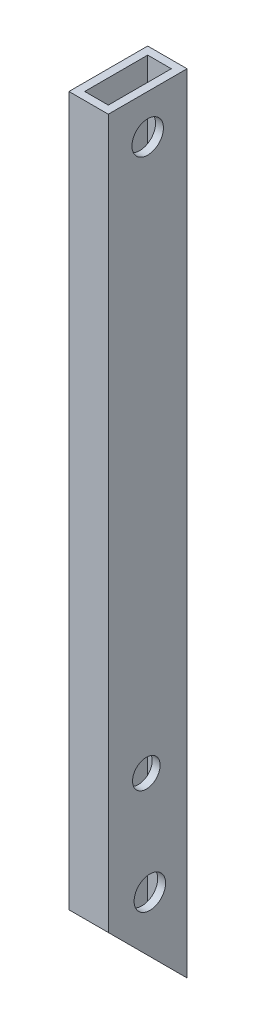
ISO-10303-21;
HEADER;
FILE_DESCRIPTION(('STEP AP214'),'2;1');
FILE_NAME('part.step','',(''),(''),'','','');
FILE_SCHEMA(('AUTOMOTIVE_DESIGN { 1 0 10303 214 1 1 1 1 }'));
ENDSEC;
DATA;
#1=APPLICATION_CONTEXT('core data for automotive mechanical design processes');
#2=APPLICATION_PROTOCOL_DEFINITION('international standard','automotive_design',2000,#1);
#3=PRODUCT_CONTEXT('',#1,'mechanical');
#4=PRODUCT('Part','Part','',(#3));
#5=PRODUCT_RELATED_PRODUCT_CATEGORY('part','',(#4));
#6=PRODUCT_DEFINITION_FORMATION('','',#4);
#7=PRODUCT_DEFINITION_CONTEXT('part definition',#1,'design');
#8=PRODUCT_DEFINITION('design','',#6,#7);
#9=PRODUCT_DEFINITION_SHAPE('','',#8);
#10=(LENGTH_UNIT() NAMED_UNIT(*) SI_UNIT(.MILLI.,.METRE.));
#11=(NAMED_UNIT(*) PLANE_ANGLE_UNIT() SI_UNIT($,.RADIAN.));
#12=(NAMED_UNIT(*) SI_UNIT($,.STERADIAN.) SOLID_ANGLE_UNIT());
#13=UNCERTAINTY_MEASURE_WITH_UNIT(LENGTH_MEASURE(1.E-05),#10,'distance_accuracy_value','');
#14=(GEOMETRIC_REPRESENTATION_CONTEXT(3) GLOBAL_UNCERTAINTY_ASSIGNED_CONTEXT((#13)) GLOBAL_UNIT_ASSIGNED_CONTEXT((#10,
#11,#12)) REPRESENTATION_CONTEXT('',''));
#15=CARTESIAN_POINT('',(0.,0.,0.));
#16=DIRECTION('',(0.,0.,1.));
#17=DIRECTION('',(1.,0.,0.));
#18=AXIS2_PLACEMENT_3D('',#15,#16,#17);
#19=CARTESIAN_POINT('',(0.,100.,20.));
#20=DIRECTION('',(0.,1.,0.));
#21=DIRECTION('',(0.,0.,1.));
#22=AXIS2_PLACEMENT_3D('',#19,#20,#21);
#23=PLANE('',#22);
#24=DIRECTION('',(1.,0.,0.));
#25=VECTOR('',#24,1.);
#26=CARTESIAN_POINT('',(0.,100.,0.));
#27=LINE('',#26,#25);
#28=CARTESIAN_POINT('',(-5.00000000000001,100.,0.));
#29=VERTEX_POINT('',#28);
#30=CARTESIAN_POINT('',(4.99999999999999,100.,0.));
#31=VERTEX_POINT('',#30);
#32=EDGE_CURVE('E138',#29,#31,#27,.T.);
#33=ORIENTED_EDGE('',*,*,#32,.F.);
#34=DIRECTION('',(0.,0.,-1.));
#35=VECTOR('',#34,1.);
#36=CARTESIAN_POINT('',(-5.00000000000001,100.,20.));
#37=LINE('',#36,#35);
#38=CARTESIAN_POINT('',(-5.00000000000001,100.,20.));
#39=VERTEX_POINT('',#38);
#40=EDGE_CURVE('E135',#39,#29,#37,.T.);
#41=ORIENTED_EDGE('',*,*,#40,.F.);
#42=DIRECTION('',(1.,0.,0.));
#43=VECTOR('',#42,1.);
#44=CARTESIAN_POINT('',(0.,100.,20.));
#45=LINE('',#44,#43);
#46=CARTESIAN_POINT('',(4.99999999999999,100.,20.));
#47=VERTEX_POINT('',#46);
#48=EDGE_CURVE('E126',#39,#47,#45,.T.);
#49=ORIENTED_EDGE('',*,*,#48,.T.);
#50=DIRECTION('',(0.,0.,-1.));
#51=VECTOR('',#50,1.);
#52=CARTESIAN_POINT('',(4.99999999999999,100.,20.));
#53=LINE('',#52,#51);
#54=EDGE_CURVE('E44',#47,#31,#53,.T.);
#55=ORIENTED_EDGE('',*,*,#54,.T.);
#56=EDGE_LOOP('',(#33,#41,#49,#55));
#57=FACE_BOUND('',#56,.T.);
#58=DIRECTION('',(0.,0.,-1.));
#59=VECTOR('',#58,1.);
#60=CARTESIAN_POINT('',(-3.00000000000001,100.,20.));
#61=LINE('',#60,#59);
#62=CARTESIAN_POINT('',(-3.00000000000001,100.,18.));
#63=VERTEX_POINT('',#62);
#64=CARTESIAN_POINT('',(-3.00000000000001,100.,2.));
#65=VERTEX_POINT('',#64);
#66=EDGE_CURVE('E198',#63,#65,#61,.T.);
#67=ORIENTED_EDGE('',*,*,#66,.T.);
#68=DIRECTION('',(1.,0.,0.));
#69=VECTOR('',#68,1.);
#70=CARTESIAN_POINT('',(0.,100.,2.));
#71=LINE('',#70,#69);
#72=CARTESIAN_POINT('',(2.99999999999999,100.,2.));
#73=VERTEX_POINT('',#72);
#74=EDGE_CURVE('E191',#65,#73,#71,.T.);
#75=ORIENTED_EDGE('',*,*,#74,.T.);
#76=DIRECTION('',(0.,0.,-1.));
#77=VECTOR('',#76,1.);
#78=CARTESIAN_POINT('',(2.99999999999999,100.,20.));
#79=LINE('',#78,#77);
#80=CARTESIAN_POINT('',(2.99999999999999,100.,18.));
#81=VERTEX_POINT('',#80);
#82=EDGE_CURVE('E139',#81,#73,#79,.T.);
#83=ORIENTED_EDGE('',*,*,#82,.F.);
#84=DIRECTION('',(1.,0.,0.));
#85=VECTOR('',#84,1.);
#86=CARTESIAN_POINT('',(0.,100.,18.));
#87=LINE('',#86,#85);
#88=EDGE_CURVE('E59',#63,#81,#87,.T.);
#89=ORIENTED_EDGE('',*,*,#88,.F.);
#90=EDGE_LOOP('',(#67,#75,#83,#89));
#91=FACE_BOUND('',#90,.T.);
#92=ADVANCED_FACE('F35',(#57,#91),#23,.T.);
#93=CARTESIAN_POINT('',(5.,0.,20.));
#94=DIRECTION('',(1.,0.,0.));
#95=DIRECTION('',(0.,1.,0.));
#96=AXIS2_PLACEMENT_3D('',#93,#94,#95);
#97=PLANE('',#96);
#98=CARTESIAN_POINT('',(5.00000000000001,-76.4045327297385,9.45333164649026));
#99=DIRECTION('',(1.,0.,0.));
#100=DIRECTION('',(0.,1.,0.));
#101=AXIS2_PLACEMENT_3D('',#98,#99,#100);
#102=CIRCLE('',#101,3.99999999998037);
#103=CARTESIAN_POINT('',(5.00000000000001,-72.4045327297581,9.45333164649026));
#104=VERTEX_POINT('',#103);
#105=EDGE_CURVE('E159',#104,#104,#102,.T.);
#106=ORIENTED_EDGE('',*,*,#105,.F.);
#107=EDGE_LOOP('',(#106));
#108=FACE_BOUND('',#107,.T.);
#109=CARTESIAN_POINT('',(5.00000000000001,-49.7720006322351,10.3471769088981));
#110=DIRECTION('',(1.,0.,0.));
#111=DIRECTION('',(0.,1.,0.));
#112=AXIS2_PLACEMENT_3D('',#109,#110,#111);
#113=CIRCLE('',#112,3.5);
#114=CARTESIAN_POINT('',(5.00000000000001,-46.2720006322351,10.3471769088981));
#115=VERTEX_POINT('',#114);
#116=EDGE_CURVE('E169',#115,#115,#113,.T.);
#117=ORIENTED_EDGE('',*,*,#116,.F.);
#118=EDGE_LOOP('',(#117));
#119=FACE_BOUND('',#118,.T.);
#120=CARTESIAN_POINT('',(4.99999999999999,90.,10.));
#121=DIRECTION('',(1.,0.,0.));
#122=DIRECTION('',(0.,1.,0.));
#123=AXIS2_PLACEMENT_3D('',#120,#121,#122);
#124=CIRCLE('',#123,4.);
#125=CARTESIAN_POINT('',(4.99999999999999,94.,10.));
#126=VERTEX_POINT('',#125);
#127=EDGE_CURVE('E175',#126,#126,#124,.T.);
#128=ORIENTED_EDGE('',*,*,#127,.F.);
#129=EDGE_LOOP('',(#128));
#130=FACE_BOUND('',#129,.T.);
#131=DIRECTION('',(0.,-0.707106781186544,-0.707106781186551));
#132=VECTOR('',#131,1.);
#133=CARTESIAN_POINT('',(5.00000000000001,-100.,0.));
#134=LINE('',#133,#132);
#135=CARTESIAN_POINT('',(5.00000000000001,-80.0000000000002,20.));
#136=VERTEX_POINT('',#135);
#137=CARTESIAN_POINT('',(5.00000000000001,-100.,0.));
#138=VERTEX_POINT('',#137);
#139=EDGE_CURVE('E102',#136,#138,#134,.T.);
#140=ORIENTED_EDGE('',*,*,#139,.T.);
#141=DIRECTION('',(0.,-1.,0.));
#142=VECTOR('',#141,1.);
#143=CARTESIAN_POINT('',(5.,0.,0.));
#144=LINE('',#143,#142);
#145=EDGE_CURVE('E136',#31,#138,#144,.T.);
#146=ORIENTED_EDGE('',*,*,#145,.F.);
#147=ORIENTED_EDGE('',*,*,#54,.F.);
#148=DIRECTION('',(0.,-1.,0.));
#149=VECTOR('',#148,1.);
#150=CARTESIAN_POINT('',(5.,0.,20.));
#151=LINE('',#150,#149);
#152=EDGE_CURVE('E120',#47,#136,#151,.T.);
#153=ORIENTED_EDGE('',*,*,#152,.T.);
#154=EDGE_LOOP('',(#140,#146,#147,#153));
#155=FACE_BOUND('',#154,.T.);
#156=ADVANCED_FACE('F37',(#108,#119,#130,#155),#97,.T.);
#157=CARTESIAN_POINT('',(-5.,0.,20.));
#158=DIRECTION('',(1.,0.,0.));
#159=DIRECTION('',(0.,1.,0.));
#160=AXIS2_PLACEMENT_3D('',#157,#158,#159);
#161=PLANE('',#160);
#162=CARTESIAN_POINT('',(-4.99999999999999,-76.4045327297385,9.45333164649026));
#163=DIRECTION('',(1.,0.,0.));
#164=DIRECTION('',(0.,1.,0.));
#165=AXIS2_PLACEMENT_3D('',#162,#163,#164);
#166=CIRCLE('',#165,3.99999999998037);
#167=CARTESIAN_POINT('',(-4.99999999999999,-72.4045327297581,9.45333164649026));
#168=VERTEX_POINT('',#167);
#169=EDGE_CURVE('E153',#168,#168,#166,.T.);
#170=ORIENTED_EDGE('',*,*,#169,.T.);
#171=EDGE_LOOP('',(#170));
#172=FACE_BOUND('',#171,.T.);
#173=CARTESIAN_POINT('',(-4.99999999999999,-49.7720006322351,10.3471769088981));
#174=DIRECTION('',(1.,0.,0.));
#175=DIRECTION('',(0.,1.,0.));
#176=AXIS2_PLACEMENT_3D('',#173,#174,#175);
#177=CIRCLE('',#176,3.5);
#178=CARTESIAN_POINT('',(-4.99999999999999,-46.2720006322351,10.3471769088981));
#179=VERTEX_POINT('',#178);
#180=EDGE_CURVE('E164',#179,#179,#177,.T.);
#181=ORIENTED_EDGE('',*,*,#180,.T.);
#182=EDGE_LOOP('',(#181));
#183=FACE_BOUND('',#182,.T.);
#184=CARTESIAN_POINT('',(-5.00000000000001,90.,10.));
#185=DIRECTION('',(1.,0.,0.));
#186=DIRECTION('',(0.,1.,0.));
#187=AXIS2_PLACEMENT_3D('',#184,#185,#186);
#188=CIRCLE('',#187,4.);
#189=CARTESIAN_POINT('',(-5.00000000000001,94.,10.));
#190=VERTEX_POINT('',#189);
#191=EDGE_CURVE('E149',#190,#190,#188,.T.);
#192=ORIENTED_EDGE('',*,*,#191,.T.);
#193=EDGE_LOOP('',(#192));
#194=FACE_BOUND('',#193,.T.);
#195=DIRECTION('',(0.,-1.,0.));
#196=VECTOR('',#195,1.);
#197=CARTESIAN_POINT('',(-5.,0.,0.));
#198=LINE('',#197,#196);
#199=CARTESIAN_POINT('',(-4.99999999999999,-100.,0.));
#200=VERTEX_POINT('',#199);
#201=EDGE_CURVE('E129',#29,#200,#198,.T.);
#202=ORIENTED_EDGE('',*,*,#201,.T.);
#203=DIRECTION('',(0.,-0.707106781186544,-0.707106781186551));
#204=VECTOR('',#203,1.);
#205=CARTESIAN_POINT('',(-4.99999999999999,-100.,0.));
#206=LINE('',#205,#204);
#207=CARTESIAN_POINT('',(-4.99999999999999,-80.0000000000002,20.));
#208=VERTEX_POINT('',#207);
#209=EDGE_CURVE('E113',#208,#200,#206,.T.);
#210=ORIENTED_EDGE('',*,*,#209,.F.);
#211=DIRECTION('',(0.,-1.,0.));
#212=VECTOR('',#211,1.);
#213=CARTESIAN_POINT('',(-5.,0.,20.));
#214=LINE('',#213,#212);
#215=EDGE_CURVE('E123',#39,#208,#214,.T.);
#216=ORIENTED_EDGE('',*,*,#215,.F.);
#217=ORIENTED_EDGE('',*,*,#40,.T.);
#218=EDGE_LOOP('',(#202,#210,#216,#217));
#219=FACE_BOUND('',#218,.T.);
#220=ADVANCED_FACE('F231',(#172,#183,#194,#219),#161,.F.);
#221=CARTESIAN_POINT('',(0.,0.,20.));
#222=DIRECTION('',(0.,0.,1.));
#223=DIRECTION('',(1.,0.,0.));
#224=AXIS2_PLACEMENT_3D('',#221,#222,#223);
#225=PLANE('',#224);
#226=DIRECTION('',(-1.,0.,0.));
#227=VECTOR('',#226,1.);
#228=CARTESIAN_POINT('',(5.00000000000001,-80.0000000000002,20.));
#229=LINE('',#228,#227);
#230=EDGE_CURVE('E105',#136,#208,#229,.T.);
#231=ORIENTED_EDGE('',*,*,#230,.F.);
#232=ORIENTED_EDGE('',*,*,#152,.F.);
#233=ORIENTED_EDGE('',*,*,#48,.F.);
#234=ORIENTED_EDGE('',*,*,#215,.T.);
#235=EDGE_LOOP('',(#231,#232,#233,#234));
#236=FACE_BOUND('',#235,.T.);
#237=ADVANCED_FACE('F118',(#236),#225,.T.);
#238=CARTESIAN_POINT('',(0.,0.,0.));
#239=DIRECTION('',(0.,0.,1.));
#240=DIRECTION('',(1.,0.,0.));
#241=AXIS2_PLACEMENT_3D('',#238,#239,#240);
#242=PLANE('',#241);
#243=ORIENTED_EDGE('',*,*,#145,.T.);
#244=DIRECTION('',(1.,0.,0.));
#245=VECTOR('',#244,1.);
#246=CARTESIAN_POINT('',(0.,-100.,0.));
#247=LINE('',#246,#245);
#248=EDGE_CURVE('E108',#200,#138,#247,.T.);
#249=ORIENTED_EDGE('',*,*,#248,.F.);
#250=ORIENTED_EDGE('',*,*,#201,.F.);
#251=ORIENTED_EDGE('',*,*,#32,.T.);
#252=EDGE_LOOP('',(#243,#249,#250,#251));
#253=FACE_BOUND('',#252,.T.);
#254=ADVANCED_FACE('F237',(#253),#242,.F.);
#255=CARTESIAN_POINT('',(3.,0.,20.));
#256=DIRECTION('',(1.,0.,0.));
#257=DIRECTION('',(0.,1.,0.));
#258=AXIS2_PLACEMENT_3D('',#255,#256,#257);
#259=PLANE('',#258);
#260=CARTESIAN_POINT('',(3.00000000000001,-76.4045327297385,9.45333164649026));
#261=DIRECTION('',(1.,0.,0.));
#262=DIRECTION('',(0.,1.,0.));
#263=AXIS2_PLACEMENT_3D('',#260,#261,#262);
#264=CIRCLE('',#263,3.99999999998037);
#265=CARTESIAN_POINT('',(3.00000000000001,-72.4045327297581,9.45333164649026));
#266=VERTEX_POINT('',#265);
#267=EDGE_CURVE('E172',#266,#266,#264,.T.);
#268=ORIENTED_EDGE('',*,*,#267,.T.);
#269=EDGE_LOOP('',(#268));
#270=FACE_BOUND('',#269,.T.);
#271=CARTESIAN_POINT('',(3.,-49.7720006322351,10.3471769088981));
#272=DIRECTION('',(1.,0.,0.));
#273=DIRECTION('',(0.,1.,0.));
#274=AXIS2_PLACEMENT_3D('',#271,#272,#273);
#275=CIRCLE('',#274,3.5);
#276=CARTESIAN_POINT('',(3.,-46.2720006322351,10.3471769088981));
#277=VERTEX_POINT('',#276);
#278=EDGE_CURVE('E152',#277,#277,#275,.T.);
#279=ORIENTED_EDGE('',*,*,#278,.T.);
#280=EDGE_LOOP('',(#279));
#281=FACE_BOUND('',#280,.T.);
#282=CARTESIAN_POINT('',(2.99999999999999,90.,10.));
#283=DIRECTION('',(1.,0.,0.));
#284=DIRECTION('',(0.,1.,0.));
#285=AXIS2_PLACEMENT_3D('',#282,#283,#284);
#286=CIRCLE('',#285,4.);
#287=CARTESIAN_POINT('',(2.99999999999999,94.,10.));
#288=VERTEX_POINT('',#287);
#289=EDGE_CURVE('E148',#288,#288,#286,.T.);
#290=ORIENTED_EDGE('',*,*,#289,.T.);
#291=EDGE_LOOP('',(#290));
#292=FACE_BOUND('',#291,.T.);
#293=DIRECTION('',(0.,-1.,0.));
#294=VECTOR('',#293,1.);
#295=CARTESIAN_POINT('',(3.,0.,2.));
#296=LINE('',#295,#294);
#297=CARTESIAN_POINT('',(3.00000000000001,-98.,2.));
#298=VERTEX_POINT('',#297);
#299=EDGE_CURVE('E188',#73,#298,#296,.T.);
#300=ORIENTED_EDGE('',*,*,#299,.T.);
#301=DIRECTION('',(0.,0.707106781186544,0.707106781186551));
#302=VECTOR('',#301,1.);
#303=CARTESIAN_POINT('',(3.,-40.0000000000005,60.0000000000001));
#304=LINE('',#303,#302);
#305=CARTESIAN_POINT('',(3.00000000000001,-82.0000000000002,18.));
#306=VERTEX_POINT('',#305);
#307=EDGE_CURVE('E51',#298,#306,#304,.T.);
#308=ORIENTED_EDGE('',*,*,#307,.T.);
#309=DIRECTION('',(0.,-1.,0.));
#310=VECTOR('',#309,1.);
#311=CARTESIAN_POINT('',(3.,0.,18.));
#312=LINE('',#311,#310);
#313=EDGE_CURVE('E192',#81,#306,#312,.T.);
#314=ORIENTED_EDGE('',*,*,#313,.F.);
#315=ORIENTED_EDGE('',*,*,#82,.T.);
#316=EDGE_LOOP('',(#300,#308,#314,#315));
#317=FACE_BOUND('',#316,.T.);
#318=ADVANCED_FACE('F212',(#270,#281,#292,#317),#259,.F.);
#319=CARTESIAN_POINT('',(-3.,0.,20.));
#320=DIRECTION('',(1.,0.,0.));
#321=DIRECTION('',(0.,1.,0.));
#322=AXIS2_PLACEMENT_3D('',#319,#320,#321);
#323=PLANE('',#322);
#324=CARTESIAN_POINT('',(-2.99999999999999,-76.4045327297385,9.45333164649026));
#325=DIRECTION('',(1.,0.,0.));
#326=DIRECTION('',(0.,1.,0.));
#327=AXIS2_PLACEMENT_3D('',#324,#325,#326);
#328=CIRCLE('',#327,3.99999999998037);
#329=CARTESIAN_POINT('',(-2.99999999999999,-72.4045327297581,9.45333164649026));
#330=VERTEX_POINT('',#329);
#331=EDGE_CURVE('E39',#330,#330,#328,.T.);
#332=ORIENTED_EDGE('',*,*,#331,.F.);
#333=EDGE_LOOP('',(#332));
#334=FACE_BOUND('',#333,.T.);
#335=CARTESIAN_POINT('',(-2.99999999999999,-49.7720006322351,10.3471769088981));
#336=DIRECTION('',(1.,0.,0.));
#337=DIRECTION('',(0.,1.,0.));
#338=AXIS2_PLACEMENT_3D('',#335,#336,#337);
#339=CIRCLE('',#338,3.5);
#340=CARTESIAN_POINT('',(-2.99999999999999,-46.2720006322351,10.3471769088981));
#341=VERTEX_POINT('',#340);
#342=EDGE_CURVE('E150',#341,#341,#339,.T.);
#343=ORIENTED_EDGE('',*,*,#342,.F.);
#344=EDGE_LOOP('',(#343));
#345=FACE_BOUND('',#344,.T.);
#346=CARTESIAN_POINT('',(-3.00000000000001,90.,10.));
#347=DIRECTION('',(1.,0.,0.));
#348=DIRECTION('',(0.,1.,0.));
#349=AXIS2_PLACEMENT_3D('',#346,#347,#348);
#350=CIRCLE('',#349,4.);
#351=CARTESIAN_POINT('',(-3.00000000000001,94.,10.));
#352=VERTEX_POINT('',#351);
#353=EDGE_CURVE('E146',#352,#352,#350,.T.);
#354=ORIENTED_EDGE('',*,*,#353,.F.);
#355=EDGE_LOOP('',(#354));
#356=FACE_BOUND('',#355,.T.);
#357=DIRECTION('',(0.,0.707106781186544,0.707106781186551));
#358=VECTOR('',#357,1.);
#359=CARTESIAN_POINT('',(-3.,-40.0000000000005,60.0000000000001));
#360=LINE('',#359,#358);
#361=CARTESIAN_POINT('',(-3.00000000000001,-98.,2.));
#362=VERTEX_POINT('',#361);
#363=CARTESIAN_POINT('',(-2.99999999999999,-82.0000000000002,18.));
#364=VERTEX_POINT('',#363);
#365=EDGE_CURVE('E124',#362,#364,#360,.T.);
#366=ORIENTED_EDGE('',*,*,#365,.F.);
#367=DIRECTION('',(0.,-1.,0.));
#368=VECTOR('',#367,1.);
#369=CARTESIAN_POINT('',(-3.,0.,2.));
#370=LINE('',#369,#368);
#371=EDGE_CURVE('E194',#65,#362,#370,.T.);
#372=ORIENTED_EDGE('',*,*,#371,.F.);
#373=ORIENTED_EDGE('',*,*,#66,.F.);
#374=DIRECTION('',(0.,-1.,0.));
#375=VECTOR('',#374,1.);
#376=CARTESIAN_POINT('',(-3.,0.,18.));
#377=LINE('',#376,#375);
#378=EDGE_CURVE('E195',#63,#364,#377,.T.);
#379=ORIENTED_EDGE('',*,*,#378,.T.);
#380=EDGE_LOOP('',(#366,#372,#373,#379));
#381=FACE_BOUND('',#380,.T.);
#382=ADVANCED_FACE('F209',(#334,#345,#356,#381),#323,.T.);
#383=CARTESIAN_POINT('',(0.,0.,18.));
#384=DIRECTION('',(0.,0.,1.));
#385=DIRECTION('',(1.,0.,0.));
#386=AXIS2_PLACEMENT_3D('',#383,#384,#385);
#387=PLANE('',#386);
#388=ORIENTED_EDGE('',*,*,#313,.T.);
#389=DIRECTION('',(-1.,0.,0.));
#390=VECTOR('',#389,1.);
#391=CARTESIAN_POINT('',(0.,-82.0000000000002,18.));
#392=LINE('',#391,#390);
#393=EDGE_CURVE('E185',#306,#364,#392,.T.);
#394=ORIENTED_EDGE('',*,*,#393,.T.);
#395=ORIENTED_EDGE('',*,*,#378,.F.);
#396=ORIENTED_EDGE('',*,*,#88,.T.);
#397=EDGE_LOOP('',(#388,#394,#395,#396));
#398=FACE_BOUND('',#397,.T.);
#399=ADVANCED_FACE('F210',(#398),#387,.F.);
#400=CARTESIAN_POINT('',(0.,0.,2.));
#401=DIRECTION('',(0.,0.,1.));
#402=DIRECTION('',(1.,0.,0.));
#403=AXIS2_PLACEMENT_3D('',#400,#401,#402);
#404=PLANE('',#403);
#405=DIRECTION('',(-1.,0.,0.));
#406=VECTOR('',#405,1.);
#407=CARTESIAN_POINT('',(0.,-98.,2.));
#408=LINE('',#407,#406);
#409=EDGE_CURVE('E11',#298,#362,#408,.T.);
#410=ORIENTED_EDGE('',*,*,#409,.F.);
#411=ORIENTED_EDGE('',*,*,#299,.F.);
#412=ORIENTED_EDGE('',*,*,#74,.F.);
#413=ORIENTED_EDGE('',*,*,#371,.T.);
#414=EDGE_LOOP('',(#410,#411,#412,#413));
#415=FACE_BOUND('',#414,.T.);
#416=ADVANCED_FACE('F215',(#415),#404,.T.);
#417=CARTESIAN_POINT('',(5.00000000000001,-100.,0.));
#418=DIRECTION('',(0.,0.707106781186551,-0.707106781186544));
#419=DIRECTION('',(0.,0.707106781186544,0.707106781186551));
#420=AXIS2_PLACEMENT_3D('',#417,#418,#419);
#421=PLANE('',#420);
#422=ORIENTED_EDGE('',*,*,#209,.T.);
#423=ORIENTED_EDGE('',*,*,#248,.T.);
#424=ORIENTED_EDGE('',*,*,#139,.F.);
#425=ORIENTED_EDGE('',*,*,#230,.T.);
#426=EDGE_LOOP('',(#422,#423,#424,#425));
#427=FACE_BOUND('',#426,.T.);
#428=ORIENTED_EDGE('',*,*,#307,.F.);
#429=ORIENTED_EDGE('',*,*,#409,.T.);
#430=ORIENTED_EDGE('',*,*,#365,.T.);
#431=ORIENTED_EDGE('',*,*,#393,.F.);
#432=EDGE_LOOP('',(#428,#429,#430,#431));
#433=FACE_BOUND('',#432,.T.);
#434=ADVANCED_FACE('F104',(#427,#433),#421,.F.);
#435=CARTESIAN_POINT('',(-5.00000000000001,90.,10.));
#436=DIRECTION('',(1.,0.,0.));
#437=DIRECTION('',(0.,1.,0.));
#438=AXIS2_PLACEMENT_3D('',#435,#436,#437);
#439=CYLINDRICAL_SURFACE('',#438,4.);
#440=ORIENTED_EDGE('',*,*,#353,.T.);
#441=EDGE_LOOP('',(#440));
#442=FACE_BOUND('',#441,.T.);
#443=ORIENTED_EDGE('',*,*,#191,.F.);
#444=EDGE_LOOP('',(#443));
#445=FACE_BOUND('',#444,.T.);
#446=ADVANCED_FACE('F222',(#442,#445),#439,.F.);
#447=ORIENTED_EDGE('',*,*,#127,.T.);
#448=EDGE_LOOP('',(#447));
#449=FACE_BOUND('',#448,.T.);
#450=ORIENTED_EDGE('',*,*,#289,.F.);
#451=EDGE_LOOP('',(#450));
#452=FACE_BOUND('',#451,.T.);
#453=ADVANCED_FACE('F287',(#449,#452),#439,.F.);
#454=CARTESIAN_POINT('',(-4.99999999999999,-49.7720006322351,10.3471769088981));
#455=DIRECTION('',(1.,0.,0.));
#456=DIRECTION('',(0.,1.,0.));
#457=AXIS2_PLACEMENT_3D('',#454,#455,#456);
#458=CYLINDRICAL_SURFACE('',#457,3.5);
#459=ORIENTED_EDGE('',*,*,#342,.T.);
#460=EDGE_LOOP('',(#459));
#461=FACE_BOUND('',#460,.T.);
#462=ORIENTED_EDGE('',*,*,#180,.F.);
#463=EDGE_LOOP('',(#462));
#464=FACE_BOUND('',#463,.T.);
#465=ADVANCED_FACE('F297',(#461,#464),#458,.F.);
#466=CARTESIAN_POINT('',(-4.99999999999999,-76.4045327297385,9.45333164649026));
#467=DIRECTION('',(1.,0.,0.));
#468=DIRECTION('',(0.,1.,0.));
#469=AXIS2_PLACEMENT_3D('',#466,#467,#468);
#470=CYLINDRICAL_SURFACE('',#469,3.99999999998037);
#471=ORIENTED_EDGE('',*,*,#331,.T.);
#472=EDGE_LOOP('',(#471));
#473=FACE_BOUND('',#472,.T.);
#474=ORIENTED_EDGE('',*,*,#169,.F.);
#475=EDGE_LOOP('',(#474));
#476=FACE_BOUND('',#475,.T.);
#477=ADVANCED_FACE('F327',(#473,#476),#470,.F.);
#478=ORIENTED_EDGE('',*,*,#116,.T.);
#479=EDGE_LOOP('',(#478));
#480=FACE_BOUND('',#479,.T.);
#481=ORIENTED_EDGE('',*,*,#278,.F.);
#482=EDGE_LOOP('',(#481));
#483=FACE_BOUND('',#482,.T.);
#484=ADVANCED_FACE('F329',(#480,#483),#458,.F.);
#485=ORIENTED_EDGE('',*,*,#105,.T.);
#486=EDGE_LOOP('',(#485));
#487=FACE_BOUND('',#486,.T.);
#488=ORIENTED_EDGE('',*,*,#267,.F.);
#489=EDGE_LOOP('',(#488));
#490=FACE_BOUND('',#489,.T.);
#491=ADVANCED_FACE('F336',(#487,#490),#470,.F.);
#492=CLOSED_SHELL('',(#92,#156,#220,#237,#254,#318,#382,#399,#416,#434,#446,#453,#465,#477,#484,#491));
#493=MANIFOLD_SOLID_BREP('B2',#492);
#494=ADVANCED_BREP_SHAPE_REPRESENTATION('',(#18,#493),#14);
#495=SHAPE_DEFINITION_REPRESENTATION(#9,#494);
ENDSEC;
END-ISO-10303-21;
